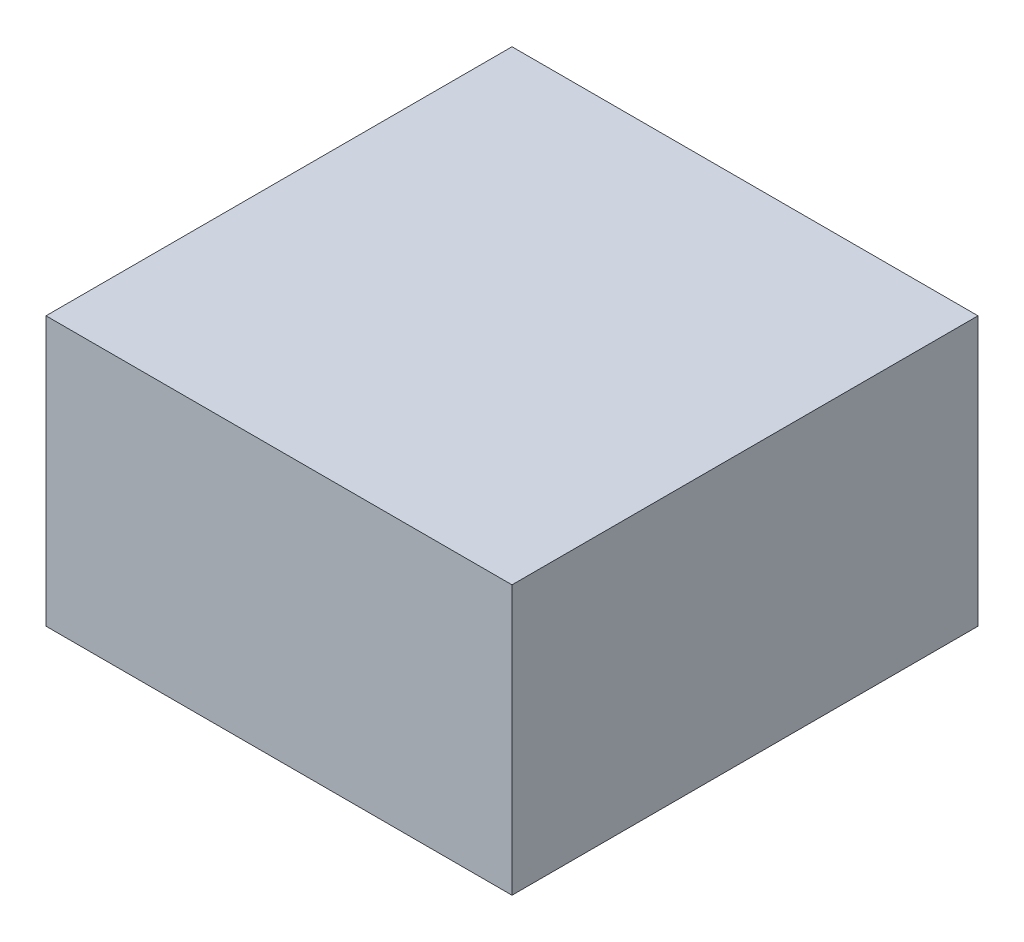
ISO-10303-21;
HEADER;
FILE_DESCRIPTION(('STEP AP214'),'2;1');
FILE_NAME('part.step','',(''),(''),'','','');
FILE_SCHEMA(('AUTOMOTIVE_DESIGN { 1 0 10303 214 1 1 1 1 }'));
ENDSEC;
DATA;
#1=APPLICATION_CONTEXT('core data for automotive mechanical design processes');
#2=APPLICATION_PROTOCOL_DEFINITION('international standard','automotive_design',2000,#1);
#3=PRODUCT_CONTEXT('',#1,'mechanical');
#4=PRODUCT('Part','Part','',(#3));
#5=PRODUCT_RELATED_PRODUCT_CATEGORY('part','',(#4));
#6=PRODUCT_DEFINITION_FORMATION('','',#4);
#7=PRODUCT_DEFINITION_CONTEXT('part definition',#1,'design');
#8=PRODUCT_DEFINITION('design','',#6,#7);
#9=PRODUCT_DEFINITION_SHAPE('','',#8);
#10=(LENGTH_UNIT() NAMED_UNIT(*) SI_UNIT(.MILLI.,.METRE.));
#11=(NAMED_UNIT(*) PLANE_ANGLE_UNIT() SI_UNIT($,.RADIAN.));
#12=(NAMED_UNIT(*) SI_UNIT($,.STERADIAN.) SOLID_ANGLE_UNIT());
#13=UNCERTAINTY_MEASURE_WITH_UNIT(LENGTH_MEASURE(1.E-05),#10,'distance_accuracy_value','');
#14=(GEOMETRIC_REPRESENTATION_CONTEXT(3) GLOBAL_UNCERTAINTY_ASSIGNED_CONTEXT((#13)) GLOBAL_UNIT_ASSIGNED_CONTEXT((#10,
#11,#12)) REPRESENTATION_CONTEXT('',''));
#15=CARTESIAN_POINT('',(0.,0.,0.));
#16=DIRECTION('',(0.,0.,1.));
#17=DIRECTION('',(1.,0.,0.));
#18=AXIS2_PLACEMENT_3D('',#15,#16,#17);
#19=CARTESIAN_POINT('',(0.,57.15,0.));
#20=DIRECTION('',(1.,0.,0.));
#21=DIRECTION('',(0.,0.,-1.));
#22=AXIS2_PLACEMENT_3D('',#19,#20,#21);
#23=PLANE('',#22);
#24=DIRECTION('',(0.,0.,1.));
#25=VECTOR('',#24,1.);
#26=CARTESIAN_POINT('',(0.,0.,0.));
#27=LINE('',#26,#25);
#28=CARTESIAN_POINT('',(0.,0.,-99.06));
#29=VERTEX_POINT('',#28);
#30=CARTESIAN_POINT('',(0.,0.,0.));
#31=VERTEX_POINT('',#30);
#32=EDGE_CURVE('E97',#29,#31,#27,.T.);
#33=ORIENTED_EDGE('',*,*,#32,.T.);
#34=DIRECTION('',(0.,-1.,0.));
#35=VECTOR('',#34,1.);
#36=CARTESIAN_POINT('',(0.,57.15,0.));
#37=LINE('',#36,#35);
#38=CARTESIAN_POINT('',(0.,57.15,0.));
#39=VERTEX_POINT('',#38);
#40=EDGE_CURVE('E11',#39,#31,#37,.T.);
#41=ORIENTED_EDGE('',*,*,#40,.F.);
#42=DIRECTION('',(0.,0.,1.));
#43=VECTOR('',#42,1.);
#44=CARTESIAN_POINT('',(0.,57.15,0.));
#45=LINE('',#44,#43);
#46=CARTESIAN_POINT('',(0.,57.15,-99.06));
#47=VERTEX_POINT('',#46);
#48=EDGE_CURVE('E85',#47,#39,#45,.T.);
#49=ORIENTED_EDGE('',*,*,#48,.F.);
#50=DIRECTION('',(0.,-1.,0.));
#51=VECTOR('',#50,1.);
#52=CARTESIAN_POINT('',(0.,57.15,-99.06));
#53=LINE('',#52,#51);
#54=EDGE_CURVE('E93',#47,#29,#53,.T.);
#55=ORIENTED_EDGE('',*,*,#54,.T.);
#56=EDGE_LOOP('',(#33,#41,#49,#55));
#57=FACE_BOUND('',#56,.T.);
#58=ADVANCED_FACE('F34',(#57),#23,.F.);
#59=CARTESIAN_POINT('',(0.,57.15,0.));
#60=DIRECTION('',(0.,0.,-1.));
#61=DIRECTION('',(-1.,0.,0.));
#62=AXIS2_PLACEMENT_3D('',#59,#60,#61);
#63=PLANE('',#62);
#64=DIRECTION('',(1.,0.,0.));
#65=VECTOR('',#64,1.);
#66=CARTESIAN_POINT('',(0.,0.,0.));
#67=LINE('',#66,#65);
#68=CARTESIAN_POINT('',(99.06,0.,0.));
#69=VERTEX_POINT('',#68);
#70=EDGE_CURVE('E89',#31,#69,#67,.T.);
#71=ORIENTED_EDGE('',*,*,#70,.T.);
#72=DIRECTION('',(0.,-1.,0.));
#73=VECTOR('',#72,1.);
#74=CARTESIAN_POINT('',(99.06,57.15,0.));
#75=LINE('',#74,#73);
#76=CARTESIAN_POINT('',(99.06,57.15,0.));
#77=VERTEX_POINT('',#76);
#78=EDGE_CURVE('E42',#77,#69,#75,.T.);
#79=ORIENTED_EDGE('',*,*,#78,.F.);
#80=DIRECTION('',(1.,0.,0.));
#81=VECTOR('',#80,1.);
#82=CARTESIAN_POINT('',(0.,57.15,0.));
#83=LINE('',#82,#81);
#84=EDGE_CURVE('E80',#39,#77,#83,.T.);
#85=ORIENTED_EDGE('',*,*,#84,.F.);
#86=ORIENTED_EDGE('',*,*,#40,.T.);
#87=EDGE_LOOP('',(#71,#79,#85,#86));
#88=FACE_BOUND('',#87,.T.);
#89=ADVANCED_FACE('F88',(#88),#63,.F.);
#90=CARTESIAN_POINT('',(99.06,57.15,0.));
#91=DIRECTION('',(-1.,0.,0.));
#92=DIRECTION('',(0.,0.,1.));
#93=AXIS2_PLACEMENT_3D('',#90,#91,#92);
#94=PLANE('',#93);
#95=DIRECTION('',(0.,0.,-1.));
#96=VECTOR('',#95,1.);
#97=CARTESIAN_POINT('',(99.06,0.,0.));
#98=LINE('',#97,#96);
#99=CARTESIAN_POINT('',(99.06,0.,-99.06));
#100=VERTEX_POINT('',#99);
#101=EDGE_CURVE('E67',#69,#100,#98,.T.);
#102=ORIENTED_EDGE('',*,*,#101,.T.);
#103=DIRECTION('',(0.,-1.,0.));
#104=VECTOR('',#103,1.);
#105=CARTESIAN_POINT('',(99.06,57.15,-99.06));
#106=LINE('',#105,#104);
#107=CARTESIAN_POINT('',(99.06,57.15,-99.06));
#108=VERTEX_POINT('',#107);
#109=EDGE_CURVE('E90',#108,#100,#106,.T.);
#110=ORIENTED_EDGE('',*,*,#109,.F.);
#111=DIRECTION('',(0.,0.,-1.));
#112=VECTOR('',#111,1.);
#113=CARTESIAN_POINT('',(99.06,57.15,0.));
#114=LINE('',#113,#112);
#115=EDGE_CURVE('E83',#77,#108,#114,.T.);
#116=ORIENTED_EDGE('',*,*,#115,.F.);
#117=ORIENTED_EDGE('',*,*,#78,.T.);
#118=EDGE_LOOP('',(#102,#110,#116,#117));
#119=FACE_BOUND('',#118,.T.);
#120=ADVANCED_FACE('F91',(#119),#94,.F.);
#121=CARTESIAN_POINT('',(0.,57.15,-99.06));
#122=DIRECTION('',(0.,0.,1.));
#123=DIRECTION('',(1.,0.,0.));
#124=AXIS2_PLACEMENT_3D('',#121,#122,#123);
#125=PLANE('',#124);
#126=DIRECTION('',(-1.,0.,0.));
#127=VECTOR('',#126,1.);
#128=CARTESIAN_POINT('',(0.,0.,-99.06));
#129=LINE('',#128,#127);
#130=EDGE_CURVE('E73',#100,#29,#129,.T.);
#131=ORIENTED_EDGE('',*,*,#130,.T.);
#132=ORIENTED_EDGE('',*,*,#54,.F.);
#133=DIRECTION('',(-1.,0.,0.));
#134=VECTOR('',#133,1.);
#135=CARTESIAN_POINT('',(0.,57.15,-99.06));
#136=LINE('',#135,#134);
#137=EDGE_CURVE('E50',#108,#47,#136,.T.);
#138=ORIENTED_EDGE('',*,*,#137,.F.);
#139=ORIENTED_EDGE('',*,*,#109,.T.);
#140=EDGE_LOOP('',(#131,#132,#138,#139));
#141=FACE_BOUND('',#140,.T.);
#142=ADVANCED_FACE('F104',(#141),#125,.F.);
#143=CARTESIAN_POINT('',(0.,57.15,0.));
#144=DIRECTION('',(0.,-1.,0.));
#145=DIRECTION('',(0.,0.,-1.));
#146=AXIS2_PLACEMENT_3D('',#143,#144,#145);
#147=PLANE('',#146);
#148=ORIENTED_EDGE('',*,*,#48,.T.);
#149=ORIENTED_EDGE('',*,*,#84,.T.);
#150=ORIENTED_EDGE('',*,*,#115,.T.);
#151=ORIENTED_EDGE('',*,*,#137,.T.);
#152=EDGE_LOOP('',(#148,#149,#150,#151));
#153=FACE_BOUND('',#152,.T.);
#154=ADVANCED_FACE('F81',(#153),#147,.F.);
#155=CARTESIAN_POINT('',(0.,0.,0.));
#156=DIRECTION('',(0.,-1.,0.));
#157=DIRECTION('',(0.,0.,-1.));
#158=AXIS2_PLACEMENT_3D('',#155,#156,#157);
#159=PLANE('',#158);
#160=ORIENTED_EDGE('',*,*,#32,.F.);
#161=ORIENTED_EDGE('',*,*,#130,.F.);
#162=ORIENTED_EDGE('',*,*,#101,.F.);
#163=ORIENTED_EDGE('',*,*,#70,.F.);
#164=EDGE_LOOP('',(#160,#161,#162,#163));
#165=FACE_BOUND('',#164,.T.);
#166=ADVANCED_FACE('F107',(#165),#159,.T.);
#167=CLOSED_SHELL('',(#58,#89,#120,#142,#154,#166));
#168=MANIFOLD_SOLID_BREP('B2',#167);
#169=ADVANCED_BREP_SHAPE_REPRESENTATION('',(#18,#168),#14);
#170=SHAPE_DEFINITION_REPRESENTATION(#9,#169);
ENDSEC;
END-ISO-10303-21;
